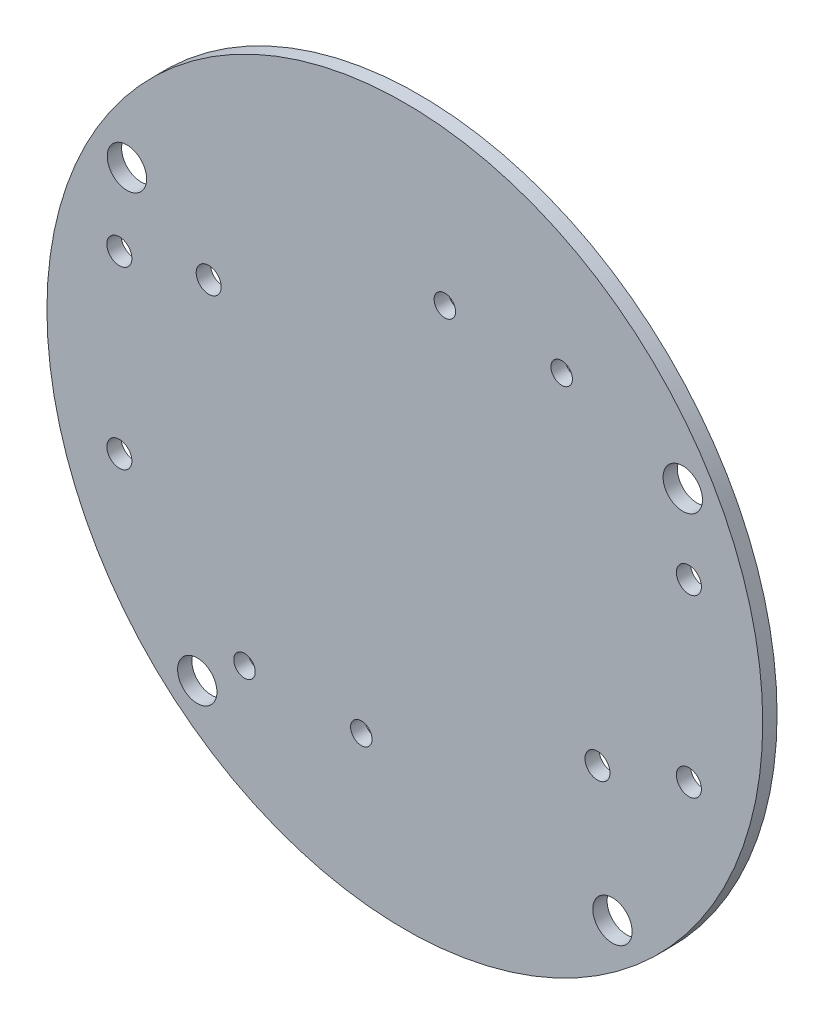
ISO-10303-21;
HEADER;
FILE_DESCRIPTION(('STEP AP214'),'2;1');
FILE_NAME('part.step','',(''),(''),'','','');
FILE_SCHEMA(('AUTOMOTIVE_DESIGN { 1 0 10303 214 1 1 1 1 }'));
ENDSEC;
DATA;
#1=APPLICATION_CONTEXT('core data for automotive mechanical design processes');
#2=APPLICATION_PROTOCOL_DEFINITION('international standard','automotive_design',2000,#1);
#3=PRODUCT_CONTEXT('',#1,'mechanical');
#4=PRODUCT('Part','Part','',(#3));
#5=PRODUCT_RELATED_PRODUCT_CATEGORY('part','',(#4));
#6=PRODUCT_DEFINITION_FORMATION('','',#4);
#7=PRODUCT_DEFINITION_CONTEXT('part definition',#1,'design');
#8=PRODUCT_DEFINITION('design','',#6,#7);
#9=PRODUCT_DEFINITION_SHAPE('','',#8);
#10=(LENGTH_UNIT() NAMED_UNIT(*) SI_UNIT(.MILLI.,.METRE.));
#11=(NAMED_UNIT(*) PLANE_ANGLE_UNIT() SI_UNIT($,.RADIAN.));
#12=(NAMED_UNIT(*) SI_UNIT($,.STERADIAN.) SOLID_ANGLE_UNIT());
#13=UNCERTAINTY_MEASURE_WITH_UNIT(LENGTH_MEASURE(1.E-05),#10,'distance_accuracy_value','');
#14=(GEOMETRIC_REPRESENTATION_CONTEXT(3) GLOBAL_UNCERTAINTY_ASSIGNED_CONTEXT((#13)) GLOBAL_UNIT_ASSIGNED_CONTEXT((#10,
#11,#12)) REPRESENTATION_CONTEXT('',''));
#15=CARTESIAN_POINT('',(0.,0.,0.));
#16=DIRECTION('',(0.,0.,1.));
#17=DIRECTION('',(1.,0.,0.));
#18=AXIS2_PLACEMENT_3D('',#15,#16,#17);
#19=CARTESIAN_POINT('',(0.,0.,2.));
#20=DIRECTION('',(0.,0.,-1.));
#21=DIRECTION('',(-1.,0.,0.));
#22=AXIS2_PLACEMENT_3D('',#19,#20,#21);
#23=CYLINDRICAL_SURFACE('',#22,50.);
#24=CARTESIAN_POINT('',(0.,0.,2.));
#25=DIRECTION('',(0.,0.,1.));
#26=DIRECTION('',(1.,0.,0.));
#27=AXIS2_PLACEMENT_3D('',#24,#25,#26);
#28=CIRCLE('',#27,50.);
#29=CARTESIAN_POINT('',(50.,0.,2.));
#30=VERTEX_POINT('',#29);
#31=EDGE_CURVE('E10',#30,#30,#28,.T.);
#32=ORIENTED_EDGE('',*,*,#31,.F.);
#33=EDGE_LOOP('',(#32));
#34=FACE_BOUND('',#33,.T.);
#35=CARTESIAN_POINT('',(0.,0.,0.));
#36=DIRECTION('',(0.,0.,1.));
#37=DIRECTION('',(1.,0.,0.));
#38=AXIS2_PLACEMENT_3D('',#35,#36,#37);
#39=CIRCLE('',#38,50.);
#40=CARTESIAN_POINT('',(50.,0.,0.));
#41=VERTEX_POINT('',#40);
#42=EDGE_CURVE('E41',#41,#41,#39,.T.);
#43=ORIENTED_EDGE('',*,*,#42,.T.);
#44=EDGE_LOOP('',(#43));
#45=FACE_BOUND('',#44,.T.);
#46=ADVANCED_FACE('F34',(#34,#45),#23,.T.);
#47=CARTESIAN_POINT('',(0.,0.,2.));
#48=DIRECTION('',(0.,0.,1.));
#49=DIRECTION('',(1.,0.,0.));
#50=AXIS2_PLACEMENT_3D('',#47,#48,#49);
#51=PLANE('',#50);
#52=CARTESIAN_POINT('',(39.68,-12.34,2.));
#53=DIRECTION('',(0.,0.,1.));
#54=DIRECTION('',(1.,0.,0.));
#55=AXIS2_PLACEMENT_3D('',#52,#53,#54);
#56=CIRCLE('',#55,1.75);
#57=CARTESIAN_POINT('',(41.43,-12.34,2.));
#58=VERTEX_POINT('',#57);
#59=EDGE_CURVE('E236',#58,#58,#56,.T.);
#60=ORIENTED_EDGE('',*,*,#59,.F.);
#61=EDGE_LOOP('',(#60));
#62=FACE_BOUND('',#61,.T.);
#63=CARTESIAN_POINT('',(5.59000000000001,28.28,2.));
#64=DIRECTION('',(0.,0.,1.));
#65=DIRECTION('',(1.,0.,0.));
#66=AXIS2_PLACEMENT_3D('',#63,#64,#65);
#67=CIRCLE('',#66,1.5);
#68=CARTESIAN_POINT('',(7.09000000000001,28.28,2.));
#69=VERTEX_POINT('',#68);
#70=EDGE_CURVE('E232',#69,#69,#67,.T.);
#71=ORIENTED_EDGE('',*,*,#70,.F.);
#72=EDGE_LOOP('',(#71));
#73=FACE_BOUND('',#72,.T.);
#74=CARTESIAN_POINT('',(21.91,28.28,2.));
#75=DIRECTION('',(0.,0.,1.));
#76=DIRECTION('',(1.,0.,0.));
#77=AXIS2_PLACEMENT_3D('',#74,#75,#76);
#78=CIRCLE('',#77,1.5);
#79=CARTESIAN_POINT('',(23.41,28.28,2.));
#80=VERTEX_POINT('',#79);
#81=EDGE_CURVE('E208',#80,#80,#78,.T.);
#82=ORIENTED_EDGE('',*,*,#81,.F.);
#83=EDGE_LOOP('',(#82));
#84=FACE_BOUND('',#83,.T.);
#85=CARTESIAN_POINT('',(-6.07999999999999,-29.3,2.));
#86=DIRECTION('',(0.,0.,1.));
#87=DIRECTION('',(1.,0.,0.));
#88=AXIS2_PLACEMENT_3D('',#85,#86,#87);
#89=CIRCLE('',#88,1.5);
#90=CARTESIAN_POINT('',(-4.57999999999999,-29.3,2.));
#91=VERTEX_POINT('',#90);
#92=EDGE_CURVE('E233',#91,#91,#89,.T.);
#93=ORIENTED_EDGE('',*,*,#92,.F.);
#94=EDGE_LOOP('',(#93));
#95=FACE_BOUND('',#94,.T.);
#96=CARTESIAN_POINT('',(39.68,12.16,2.));
#97=DIRECTION('',(0.,0.,1.));
#98=DIRECTION('',(1.,0.,0.));
#99=AXIS2_PLACEMENT_3D('',#96,#97,#98);
#100=CIRCLE('',#99,1.75);
#101=CARTESIAN_POINT('',(41.43,12.16,2.));
#102=VERTEX_POINT('',#101);
#103=EDGE_CURVE('E244',#102,#102,#100,.T.);
#104=ORIENTED_EDGE('',*,*,#103,.F.);
#105=EDGE_LOOP('',(#104));
#106=FACE_BOUND('',#105,.T.);
#107=CARTESIAN_POINT('',(-39.88,12.11,2.));
#108=DIRECTION('',(0.,0.,1.));
#109=DIRECTION('',(1.,0.,0.));
#110=AXIS2_PLACEMENT_3D('',#107,#108,#109);
#111=CIRCLE('',#110,1.75);
#112=CARTESIAN_POINT('',(-38.13,12.11,2.));
#113=VERTEX_POINT('',#112);
#114=EDGE_CURVE('E252',#113,#113,#111,.T.);
#115=ORIENTED_EDGE('',*,*,#114,.F.);
#116=EDGE_LOOP('',(#115));
#117=FACE_BOUND('',#116,.T.);
#118=CARTESIAN_POINT('',(-39.88,-12.4,2.));
#119=DIRECTION('',(0.,0.,1.));
#120=DIRECTION('',(1.,0.,0.));
#121=AXIS2_PLACEMENT_3D('',#118,#119,#120);
#122=CIRCLE('',#121,1.75);
#123=CARTESIAN_POINT('',(-38.13,-12.4,2.));
#124=VERTEX_POINT('',#123);
#125=EDGE_CURVE('E249',#124,#124,#122,.T.);
#126=ORIENTED_EDGE('',*,*,#125,.F.);
#127=EDGE_LOOP('',(#126));
#128=FACE_BOUND('',#127,.T.);
#129=CARTESIAN_POINT('',(26.91,-16.73,2.));
#130=DIRECTION('',(0.,0.,1.));
#131=DIRECTION('',(1.,0.,0.));
#132=AXIS2_PLACEMENT_3D('',#129,#130,#131);
#133=CIRCLE('',#132,1.75);
#134=CARTESIAN_POINT('',(28.66,-16.73,2.));
#135=VERTEX_POINT('',#134);
#136=EDGE_CURVE('E246',#135,#135,#133,.T.);
#137=ORIENTED_EDGE('',*,*,#136,.F.);
#138=EDGE_LOOP('',(#137));
#139=FACE_BOUND('',#138,.T.);
#140=CARTESIAN_POINT('',(-22.4,-29.3,2.));
#141=DIRECTION('',(0.,0.,1.));
#142=DIRECTION('',(1.,0.,0.));
#143=AXIS2_PLACEMENT_3D('',#140,#141,#142);
#144=CIRCLE('',#143,1.5);
#145=CARTESIAN_POINT('',(-20.9,-29.3,2.));
#146=VERTEX_POINT('',#145);
#147=EDGE_CURVE('E239',#146,#146,#144,.T.);
#148=ORIENTED_EDGE('',*,*,#147,.F.);
#149=EDGE_LOOP('',(#148));
#150=FACE_BOUND('',#149,.T.);
#151=CARTESIAN_POINT('',(-27.4,14.89,2.));
#152=DIRECTION('',(0.,0.,1.));
#153=DIRECTION('',(1.,0.,0.));
#154=AXIS2_PLACEMENT_3D('',#151,#152,#153);
#155=CIRCLE('',#154,1.75);
#156=CARTESIAN_POINT('',(-25.65,14.89,2.));
#157=VERTEX_POINT('',#156);
#158=EDGE_CURVE('E56',#157,#157,#155,.T.);
#159=ORIENTED_EDGE('',*,*,#158,.F.);
#160=EDGE_LOOP('',(#159));
#161=FACE_BOUND('',#160,.T.);
#162=CARTESIAN_POINT('',(38.8241975308642,22.7526193235952,2.));
#163=DIRECTION('',(0.,0.,1.));
#164=DIRECTION('',(1.,0.,0.));
#165=AXIS2_PLACEMENT_3D('',#162,#163,#164);
#166=CIRCLE('',#165,2.75);
#167=CARTESIAN_POINT('',(41.5741975308642,22.7526193235952,2.));
#168=VERTEX_POINT('',#167);
#169=EDGE_CURVE('E81',#168,#168,#166,.T.);
#170=ORIENTED_EDGE('',*,*,#169,.F.);
#171=EDGE_LOOP('',(#170));
#172=FACE_BOUND('',#171,.T.);
#173=CARTESIAN_POINT('',(-38.8241975308642,22.7526193235952,2.));
#174=DIRECTION('',(0.,0.,1.));
#175=DIRECTION('',(1.,0.,0.));
#176=AXIS2_PLACEMENT_3D('',#173,#174,#175);
#177=CIRCLE('',#176,2.75);
#178=CARTESIAN_POINT('',(-36.0741975308642,22.7526193235952,2.));
#179=VERTEX_POINT('',#178);
#180=EDGE_CURVE('E90',#179,#179,#177,.T.);
#181=ORIENTED_EDGE('',*,*,#180,.F.);
#182=EDGE_LOOP('',(#181));
#183=FACE_BOUND('',#182,.T.);
#184=CARTESIAN_POINT('',(29.,-34.4093010681705,2.));
#185=DIRECTION('',(0.,0.,1.));
#186=DIRECTION('',(1.,0.,0.));
#187=AXIS2_PLACEMENT_3D('',#184,#185,#186);
#188=CIRCLE('',#187,2.75);
#189=CARTESIAN_POINT('',(31.75,-34.4093010681705,2.));
#190=VERTEX_POINT('',#189);
#191=EDGE_CURVE('E101',#190,#190,#188,.T.);
#192=ORIENTED_EDGE('',*,*,#191,.F.);
#193=EDGE_LOOP('',(#192));
#194=FACE_BOUND('',#193,.T.);
#195=CARTESIAN_POINT('',(-29.,-34.4093010681705,2.));
#196=DIRECTION('',(0.,0.,1.));
#197=DIRECTION('',(1.,0.,0.));
#198=AXIS2_PLACEMENT_3D('',#195,#196,#197);
#199=CIRCLE('',#198,2.75);
#200=CARTESIAN_POINT('',(-26.25,-34.4093010681705,2.));
#201=VERTEX_POINT('',#200);
#202=EDGE_CURVE('E49',#201,#201,#199,.T.);
#203=ORIENTED_EDGE('',*,*,#202,.F.);
#204=EDGE_LOOP('',(#203));
#205=FACE_BOUND('',#204,.T.);
#206=ORIENTED_EDGE('',*,*,#31,.T.);
#207=EDGE_LOOP('',(#206));
#208=FACE_BOUND('',#207,.T.);
#209=ADVANCED_FACE('F117',(#62,#73,#84,#95,#106,#117,#128,#139,#150,#161,#172,#183,#194,#205,
#208),#51,.T.);
#210=CARTESIAN_POINT('',(0.,0.,0.));
#211=DIRECTION('',(0.,0.,1.));
#212=DIRECTION('',(1.,0.,0.));
#213=AXIS2_PLACEMENT_3D('',#210,#211,#212);
#214=PLANE('',#213);
#215=CARTESIAN_POINT('',(39.68,-12.34,0.));
#216=DIRECTION('',(0.,0.,1.));
#217=DIRECTION('',(1.,0.,0.));
#218=AXIS2_PLACEMENT_3D('',#215,#216,#217);
#219=CIRCLE('',#218,1.75);
#220=CARTESIAN_POINT('',(41.43,-12.34,0.));
#221=VERTEX_POINT('',#220);
#222=EDGE_CURVE('E37',#221,#221,#219,.T.);
#223=ORIENTED_EDGE('',*,*,#222,.T.);
#224=EDGE_LOOP('',(#223));
#225=FACE_BOUND('',#224,.T.);
#226=CARTESIAN_POINT('',(5.59000000000001,28.28,0.));
#227=DIRECTION('',(0.,0.,1.));
#228=DIRECTION('',(1.,0.,0.));
#229=AXIS2_PLACEMENT_3D('',#226,#227,#228);
#230=CIRCLE('',#229,1.5);
#231=CARTESIAN_POINT('',(7.09000000000001,28.28,0.));
#232=VERTEX_POINT('',#231);
#233=EDGE_CURVE('E76',#232,#232,#230,.T.);
#234=ORIENTED_EDGE('',*,*,#233,.T.);
#235=EDGE_LOOP('',(#234));
#236=FACE_BOUND('',#235,.T.);
#237=CARTESIAN_POINT('',(21.91,28.28,0.));
#238=DIRECTION('',(0.,0.,1.));
#239=DIRECTION('',(1.,0.,0.));
#240=AXIS2_PLACEMENT_3D('',#237,#238,#239);
#241=CIRCLE('',#240,1.5);
#242=CARTESIAN_POINT('',(23.41,28.28,0.));
#243=VERTEX_POINT('',#242);
#244=EDGE_CURVE('E74',#243,#243,#241,.T.);
#245=ORIENTED_EDGE('',*,*,#244,.T.);
#246=EDGE_LOOP('',(#245));
#247=FACE_BOUND('',#246,.T.);
#248=CARTESIAN_POINT('',(-6.07999999999999,-29.3,0.));
#249=DIRECTION('',(0.,0.,1.));
#250=DIRECTION('',(1.,0.,0.));
#251=AXIS2_PLACEMENT_3D('',#248,#249,#250);
#252=CIRCLE('',#251,1.5);
#253=CARTESIAN_POINT('',(-4.57999999999999,-29.3,0.));
#254=VERTEX_POINT('',#253);
#255=EDGE_CURVE('E71',#254,#254,#252,.T.);
#256=ORIENTED_EDGE('',*,*,#255,.T.);
#257=EDGE_LOOP('',(#256));
#258=FACE_BOUND('',#257,.T.);
#259=CARTESIAN_POINT('',(39.68,12.16,0.));
#260=DIRECTION('',(0.,0.,1.));
#261=DIRECTION('',(1.,0.,0.));
#262=AXIS2_PLACEMENT_3D('',#259,#260,#261);
#263=CIRCLE('',#262,1.75);
#264=CARTESIAN_POINT('',(41.43,12.16,0.));
#265=VERTEX_POINT('',#264);
#266=EDGE_CURVE('E68',#265,#265,#263,.T.);
#267=ORIENTED_EDGE('',*,*,#266,.T.);
#268=EDGE_LOOP('',(#267));
#269=FACE_BOUND('',#268,.T.);
#270=CARTESIAN_POINT('',(-39.88,12.11,0.));
#271=DIRECTION('',(0.,0.,1.));
#272=DIRECTION('',(1.,0.,0.));
#273=AXIS2_PLACEMENT_3D('',#270,#271,#272);
#274=CIRCLE('',#273,1.75);
#275=CARTESIAN_POINT('',(-38.13,12.11,0.));
#276=VERTEX_POINT('',#275);
#277=EDGE_CURVE('E65',#276,#276,#274,.T.);
#278=ORIENTED_EDGE('',*,*,#277,.T.);
#279=EDGE_LOOP('',(#278));
#280=FACE_BOUND('',#279,.T.);
#281=CARTESIAN_POINT('',(-39.88,-12.4,0.));
#282=DIRECTION('',(0.,0.,1.));
#283=DIRECTION('',(1.,0.,0.));
#284=AXIS2_PLACEMENT_3D('',#281,#282,#283);
#285=CIRCLE('',#284,1.75);
#286=CARTESIAN_POINT('',(-38.13,-12.4,0.));
#287=VERTEX_POINT('',#286);
#288=EDGE_CURVE('E62',#287,#287,#285,.T.);
#289=ORIENTED_EDGE('',*,*,#288,.T.);
#290=EDGE_LOOP('',(#289));
#291=FACE_BOUND('',#290,.T.);
#292=CARTESIAN_POINT('',(26.91,-16.73,0.));
#293=DIRECTION('',(0.,0.,1.));
#294=DIRECTION('',(1.,0.,0.));
#295=AXIS2_PLACEMENT_3D('',#292,#293,#294);
#296=CIRCLE('',#295,1.75);
#297=CARTESIAN_POINT('',(28.66,-16.73,0.));
#298=VERTEX_POINT('',#297);
#299=EDGE_CURVE('E59',#298,#298,#296,.T.);
#300=ORIENTED_EDGE('',*,*,#299,.T.);
#301=EDGE_LOOP('',(#300));
#302=FACE_BOUND('',#301,.T.);
#303=CARTESIAN_POINT('',(-22.4,-29.3,0.));
#304=DIRECTION('',(0.,0.,1.));
#305=DIRECTION('',(1.,0.,0.));
#306=AXIS2_PLACEMENT_3D('',#303,#304,#305);
#307=CIRCLE('',#306,1.5);
#308=CARTESIAN_POINT('',(-20.9,-29.3,0.));
#309=VERTEX_POINT('',#308);
#310=EDGE_CURVE('E55',#309,#309,#307,.T.);
#311=ORIENTED_EDGE('',*,*,#310,.T.);
#312=EDGE_LOOP('',(#311));
#313=FACE_BOUND('',#312,.T.);
#314=CARTESIAN_POINT('',(-27.4,14.89,0.));
#315=DIRECTION('',(0.,0.,1.));
#316=DIRECTION('',(1.,0.,0.));
#317=AXIS2_PLACEMENT_3D('',#314,#315,#316);
#318=CIRCLE('',#317,1.75);
#319=CARTESIAN_POINT('',(-25.65,14.89,0.));
#320=VERTEX_POINT('',#319);
#321=EDGE_CURVE('E52',#320,#320,#318,.T.);
#322=ORIENTED_EDGE('',*,*,#321,.T.);
#323=EDGE_LOOP('',(#322));
#324=FACE_BOUND('',#323,.T.);
#325=CARTESIAN_POINT('',(38.8241975308642,22.7526193235952,0.));
#326=DIRECTION('',(0.,0.,1.));
#327=DIRECTION('',(1.,0.,0.));
#328=AXIS2_PLACEMENT_3D('',#325,#326,#327);
#329=CIRCLE('',#328,2.75);
#330=CARTESIAN_POINT('',(41.5741975308642,22.7526193235952,0.));
#331=VERTEX_POINT('',#330);
#332=EDGE_CURVE('E85',#331,#331,#329,.T.);
#333=ORIENTED_EDGE('',*,*,#332,.T.);
#334=EDGE_LOOP('',(#333));
#335=FACE_BOUND('',#334,.T.);
#336=CARTESIAN_POINT('',(-38.8241975308642,22.7526193235952,0.));
#337=DIRECTION('',(0.,0.,1.));
#338=DIRECTION('',(1.,0.,0.));
#339=AXIS2_PLACEMENT_3D('',#336,#337,#338);
#340=CIRCLE('',#339,2.75);
#341=CARTESIAN_POINT('',(-36.0741975308642,22.7526193235952,0.));
#342=VERTEX_POINT('',#341);
#343=EDGE_CURVE('E106',#342,#342,#340,.T.);
#344=ORIENTED_EDGE('',*,*,#343,.T.);
#345=EDGE_LOOP('',(#344));
#346=FACE_BOUND('',#345,.T.);
#347=CARTESIAN_POINT('',(29.,-34.4093010681705,0.));
#348=DIRECTION('',(0.,0.,1.));
#349=DIRECTION('',(1.,0.,0.));
#350=AXIS2_PLACEMENT_3D('',#347,#348,#349);
#351=CIRCLE('',#350,2.75);
#352=CARTESIAN_POINT('',(31.75,-34.4093010681705,0.));
#353=VERTEX_POINT('',#352);
#354=EDGE_CURVE('E97',#353,#353,#351,.T.);
#355=ORIENTED_EDGE('',*,*,#354,.T.);
#356=EDGE_LOOP('',(#355));
#357=FACE_BOUND('',#356,.T.);
#358=CARTESIAN_POINT('',(-29.,-34.4093010681705,0.));
#359=DIRECTION('',(0.,0.,1.));
#360=DIRECTION('',(1.,0.,0.));
#361=AXIS2_PLACEMENT_3D('',#358,#359,#360);
#362=CIRCLE('',#361,2.75);
#363=CARTESIAN_POINT('',(-26.25,-34.4093010681705,0.));
#364=VERTEX_POINT('',#363);
#365=EDGE_CURVE('E46',#364,#364,#362,.T.);
#366=ORIENTED_EDGE('',*,*,#365,.T.);
#367=EDGE_LOOP('',(#366));
#368=FACE_BOUND('',#367,.T.);
#369=ORIENTED_EDGE('',*,*,#42,.F.);
#370=EDGE_LOOP('',(#369));
#371=FACE_BOUND('',#370,.T.);
#372=ADVANCED_FACE('F120',(#225,#236,#247,#258,#269,#280,#291,#302,#313,#324,#335,#346,#357,
#368,#371),#214,.F.);
#373=CARTESIAN_POINT('',(-29.,-34.4093010681705,0.));
#374=DIRECTION('',(0.,0.,1.));
#375=DIRECTION('',(1.,0.,0.));
#376=AXIS2_PLACEMENT_3D('',#373,#374,#375);
#377=CYLINDRICAL_SURFACE('',#376,2.75);
#378=ORIENTED_EDGE('',*,*,#365,.F.);
#379=EDGE_LOOP('',(#378));
#380=FACE_BOUND('',#379,.T.);
#381=ORIENTED_EDGE('',*,*,#202,.T.);
#382=EDGE_LOOP('',(#381));
#383=FACE_BOUND('',#382,.T.);
#384=ADVANCED_FACE('F128',(#380,#383),#377,.F.);
#385=CARTESIAN_POINT('',(29.,-34.4093010681705,0.));
#386=DIRECTION('',(0.,0.,1.));
#387=DIRECTION('',(1.,0.,0.));
#388=AXIS2_PLACEMENT_3D('',#385,#386,#387);
#389=CYLINDRICAL_SURFACE('',#388,2.75);
#390=ORIENTED_EDGE('',*,*,#354,.F.);
#391=EDGE_LOOP('',(#390));
#392=FACE_BOUND('',#391,.T.);
#393=ORIENTED_EDGE('',*,*,#191,.T.);
#394=EDGE_LOOP('',(#393));
#395=FACE_BOUND('',#394,.T.);
#396=ADVANCED_FACE('F126',(#392,#395),#389,.F.);
#397=CARTESIAN_POINT('',(-38.8241975308642,22.7526193235952,0.));
#398=DIRECTION('',(0.,0.,1.));
#399=DIRECTION('',(1.,0.,0.));
#400=AXIS2_PLACEMENT_3D('',#397,#398,#399);
#401=CYLINDRICAL_SURFACE('',#400,2.75);
#402=ORIENTED_EDGE('',*,*,#343,.F.);
#403=EDGE_LOOP('',(#402));
#404=FACE_BOUND('',#403,.T.);
#405=ORIENTED_EDGE('',*,*,#180,.T.);
#406=EDGE_LOOP('',(#405));
#407=FACE_BOUND('',#406,.T.);
#408=ADVANCED_FACE('F115',(#404,#407),#401,.F.);
#409=CARTESIAN_POINT('',(38.8241975308642,22.7526193235952,0.));
#410=DIRECTION('',(0.,0.,1.));
#411=DIRECTION('',(1.,0.,0.));
#412=AXIS2_PLACEMENT_3D('',#409,#410,#411);
#413=CYLINDRICAL_SURFACE('',#412,2.75);
#414=ORIENTED_EDGE('',*,*,#332,.F.);
#415=EDGE_LOOP('',(#414));
#416=FACE_BOUND('',#415,.T.);
#417=ORIENTED_EDGE('',*,*,#169,.T.);
#418=EDGE_LOOP('',(#417));
#419=FACE_BOUND('',#418,.T.);
#420=ADVANCED_FACE('F135',(#416,#419),#413,.F.);
#421=CARTESIAN_POINT('',(-27.4,14.89,-8.));
#422=DIRECTION('',(0.,0.,1.));
#423=DIRECTION('',(1.,0.,0.));
#424=AXIS2_PLACEMENT_3D('',#421,#422,#423);
#425=CYLINDRICAL_SURFACE('',#424,1.75);
#426=ORIENTED_EDGE('',*,*,#158,.T.);
#427=EDGE_LOOP('',(#426));
#428=FACE_BOUND('',#427,.T.);
#429=ORIENTED_EDGE('',*,*,#321,.F.);
#430=EDGE_LOOP('',(#429));
#431=FACE_BOUND('',#430,.T.);
#432=ADVANCED_FACE('F153',(#428,#431),#425,.F.);
#433=CARTESIAN_POINT('',(-22.4,-29.3,-8.));
#434=DIRECTION('',(0.,0.,1.));
#435=DIRECTION('',(1.,0.,0.));
#436=AXIS2_PLACEMENT_3D('',#433,#434,#435);
#437=CYLINDRICAL_SURFACE('',#436,1.5);
#438=ORIENTED_EDGE('',*,*,#147,.T.);
#439=EDGE_LOOP('',(#438));
#440=FACE_BOUND('',#439,.T.);
#441=ORIENTED_EDGE('',*,*,#310,.F.);
#442=EDGE_LOOP('',(#441));
#443=FACE_BOUND('',#442,.T.);
#444=ADVANCED_FACE('F158',(#440,#443),#437,.F.);
#445=CARTESIAN_POINT('',(26.91,-16.73,-8.));
#446=DIRECTION('',(0.,0.,1.));
#447=DIRECTION('',(1.,0.,0.));
#448=AXIS2_PLACEMENT_3D('',#445,#446,#447);
#449=CYLINDRICAL_SURFACE('',#448,1.75);
#450=ORIENTED_EDGE('',*,*,#136,.T.);
#451=EDGE_LOOP('',(#450));
#452=FACE_BOUND('',#451,.T.);
#453=ORIENTED_EDGE('',*,*,#299,.F.);
#454=EDGE_LOOP('',(#453));
#455=FACE_BOUND('',#454,.T.);
#456=ADVANCED_FACE('F167',(#452,#455),#449,.F.);
#457=CARTESIAN_POINT('',(-39.88,-12.4,-8.));
#458=DIRECTION('',(0.,0.,1.));
#459=DIRECTION('',(1.,0.,0.));
#460=AXIS2_PLACEMENT_3D('',#457,#458,#459);
#461=CYLINDRICAL_SURFACE('',#460,1.75);
#462=ORIENTED_EDGE('',*,*,#125,.T.);
#463=EDGE_LOOP('',(#462));
#464=FACE_BOUND('',#463,.T.);
#465=ORIENTED_EDGE('',*,*,#288,.F.);
#466=EDGE_LOOP('',(#465));
#467=FACE_BOUND('',#466,.T.);
#468=ADVANCED_FACE('F181',(#464,#467),#461,.F.);
#469=CARTESIAN_POINT('',(-39.88,12.11,-8.));
#470=DIRECTION('',(0.,0.,1.));
#471=DIRECTION('',(1.,0.,0.));
#472=AXIS2_PLACEMENT_3D('',#469,#470,#471);
#473=CYLINDRICAL_SURFACE('',#472,1.75);
#474=ORIENTED_EDGE('',*,*,#114,.T.);
#475=EDGE_LOOP('',(#474));
#476=FACE_BOUND('',#475,.T.);
#477=ORIENTED_EDGE('',*,*,#277,.F.);
#478=EDGE_LOOP('',(#477));
#479=FACE_BOUND('',#478,.T.);
#480=ADVANCED_FACE('F177',(#476,#479),#473,.F.);
#481=CARTESIAN_POINT('',(39.68,12.16,-8.));
#482=DIRECTION('',(0.,0.,1.));
#483=DIRECTION('',(1.,0.,0.));
#484=AXIS2_PLACEMENT_3D('',#481,#482,#483);
#485=CYLINDRICAL_SURFACE('',#484,1.75);
#486=ORIENTED_EDGE('',*,*,#103,.T.);
#487=EDGE_LOOP('',(#486));
#488=FACE_BOUND('',#487,.T.);
#489=ORIENTED_EDGE('',*,*,#266,.F.);
#490=EDGE_LOOP('',(#489));
#491=FACE_BOUND('',#490,.T.);
#492=ADVANCED_FACE('F173',(#488,#491),#485,.F.);
#493=CARTESIAN_POINT('',(-6.07999999999999,-29.3,-8.));
#494=DIRECTION('',(0.,0.,1.));
#495=DIRECTION('',(1.,0.,0.));
#496=AXIS2_PLACEMENT_3D('',#493,#494,#495);
#497=CYLINDRICAL_SURFACE('',#496,1.5);
#498=ORIENTED_EDGE('',*,*,#92,.T.);
#499=EDGE_LOOP('',(#498));
#500=FACE_BOUND('',#499,.T.);
#501=ORIENTED_EDGE('',*,*,#255,.F.);
#502=EDGE_LOOP('',(#501));
#503=FACE_BOUND('',#502,.T.);
#504=ADVANCED_FACE('F176',(#500,#503),#497,.F.);
#505=CARTESIAN_POINT('',(21.91,28.28,-8.));
#506=DIRECTION('',(0.,0.,1.));
#507=DIRECTION('',(1.,0.,0.));
#508=AXIS2_PLACEMENT_3D('',#505,#506,#507);
#509=CYLINDRICAL_SURFACE('',#508,1.5);
#510=ORIENTED_EDGE('',*,*,#81,.T.);
#511=EDGE_LOOP('',(#510));
#512=FACE_BOUND('',#511,.T.);
#513=ORIENTED_EDGE('',*,*,#244,.F.);
#514=EDGE_LOOP('',(#513));
#515=FACE_BOUND('',#514,.T.);
#516=ADVANCED_FACE('F193',(#512,#515),#509,.F.);
#517=CARTESIAN_POINT('',(5.59000000000001,28.28,-8.));
#518=DIRECTION('',(0.,0.,1.));
#519=DIRECTION('',(1.,0.,0.));
#520=AXIS2_PLACEMENT_3D('',#517,#518,#519);
#521=CYLINDRICAL_SURFACE('',#520,1.5);
#522=ORIENTED_EDGE('',*,*,#70,.T.);
#523=EDGE_LOOP('',(#522));
#524=FACE_BOUND('',#523,.T.);
#525=ORIENTED_EDGE('',*,*,#233,.F.);
#526=EDGE_LOOP('',(#525));
#527=FACE_BOUND('',#526,.T.);
#528=ADVANCED_FACE('F189',(#524,#527),#521,.F.);
#529=CARTESIAN_POINT('',(39.68,-12.34,-8.));
#530=DIRECTION('',(0.,0.,1.));
#531=DIRECTION('',(1.,0.,0.));
#532=AXIS2_PLACEMENT_3D('',#529,#530,#531);
#533=CYLINDRICAL_SURFACE('',#532,1.75);
#534=ORIENTED_EDGE('',*,*,#59,.T.);
#535=EDGE_LOOP('',(#534));
#536=FACE_BOUND('',#535,.T.);
#537=ORIENTED_EDGE('',*,*,#222,.F.);
#538=EDGE_LOOP('',(#537));
#539=FACE_BOUND('',#538,.T.);
#540=ADVANCED_FACE('F192',(#536,#539),#533,.F.);
#541=CLOSED_SHELL('',(#46,#209,#372,#384,#396,#408,#420,#432,#444,#456,#468,#480,#492,#504,#516,
#528,#540));
#542=MANIFOLD_SOLID_BREP('B2',#541);
#543=ADVANCED_BREP_SHAPE_REPRESENTATION('',(#18,#542),#14);
#544=SHAPE_DEFINITION_REPRESENTATION(#9,#543);
ENDSEC;
END-ISO-10303-21;
